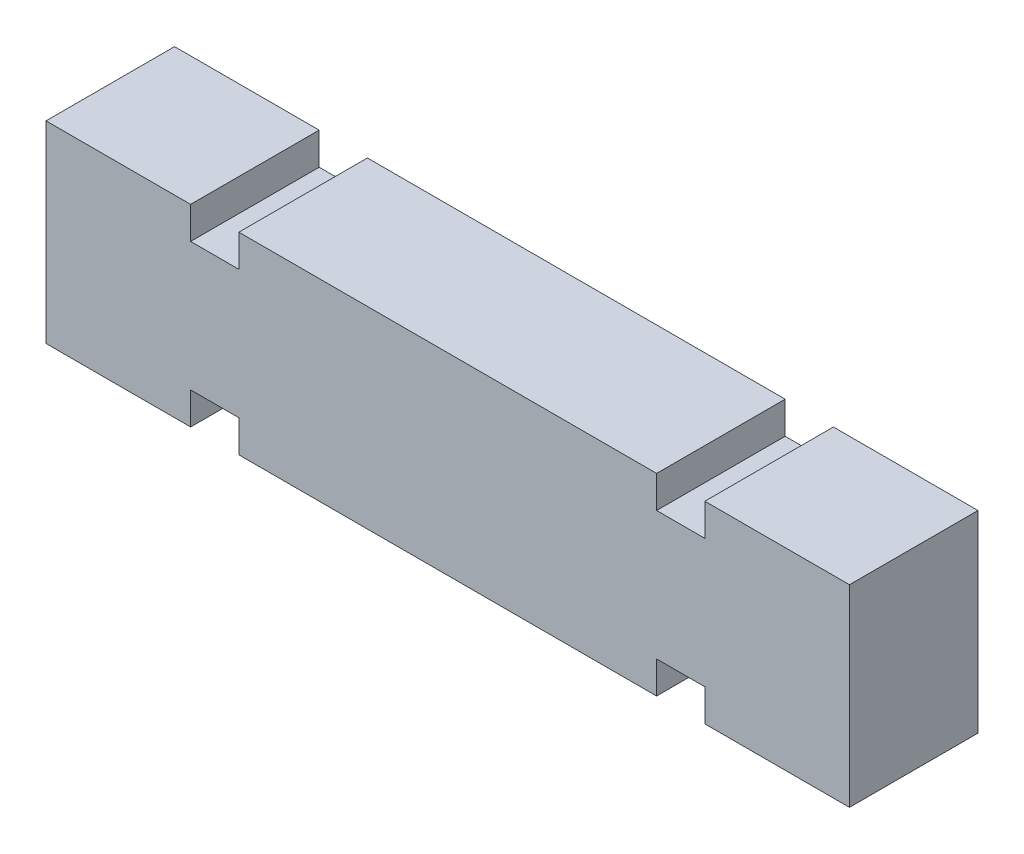
ISO-10303-21;
HEADER;
FILE_DESCRIPTION(('STEP AP214'),'2;1');
FILE_NAME('part.step','',(''),(''),'','','');
FILE_SCHEMA(('AUTOMOTIVE_DESIGN { 1 0 10303 214 1 1 1 1 }'));
ENDSEC;
DATA;
#1=APPLICATION_CONTEXT('core data for automotive mechanical design processes');
#2=APPLICATION_PROTOCOL_DEFINITION('international standard','automotive_design',2000,#1);
#3=PRODUCT_CONTEXT('',#1,'mechanical');
#4=PRODUCT('Part','Part','',(#3));
#5=PRODUCT_RELATED_PRODUCT_CATEGORY('part','',(#4));
#6=PRODUCT_DEFINITION_FORMATION('','',#4);
#7=PRODUCT_DEFINITION_CONTEXT('part definition',#1,'design');
#8=PRODUCT_DEFINITION('design','',#6,#7);
#9=PRODUCT_DEFINITION_SHAPE('','',#8);
#10=(LENGTH_UNIT() NAMED_UNIT(*) SI_UNIT(.MILLI.,.METRE.));
#11=(NAMED_UNIT(*) PLANE_ANGLE_UNIT() SI_UNIT($,.RADIAN.));
#12=(NAMED_UNIT(*) SI_UNIT($,.STERADIAN.) SOLID_ANGLE_UNIT());
#13=UNCERTAINTY_MEASURE_WITH_UNIT(LENGTH_MEASURE(1.E-05),#10,'distance_accuracy_value','');
#14=(GEOMETRIC_REPRESENTATION_CONTEXT(3) GLOBAL_UNCERTAINTY_ASSIGNED_CONTEXT((#13)) GLOBAL_UNIT_ASSIGNED_CONTEXT((#10,
#11,#12)) REPRESENTATION_CONTEXT('',''));
#15=CARTESIAN_POINT('',(0.,0.,0.));
#16=DIRECTION('',(0.,0.,1.));
#17=DIRECTION('',(1.,0.,0.));
#18=AXIS2_PLACEMENT_3D('',#15,#16,#17);
#19=CARTESIAN_POINT('',(25.,0.,-1.99999999999995));
#20=DIRECTION('',(0.,1.,0.));
#21=DIRECTION('',(0.,0.,1.));
#22=AXIS2_PLACEMENT_3D('',#19,#20,#21);
#23=PLANE('',#22);
#24=DIRECTION('',(-1.,0.,0.));
#25=VECTOR('',#24,1.);
#26=CARTESIAN_POINT('',(25.,0.,-1.99999999999995));
#27=LINE('',#26,#25);
#28=CARTESIAN_POINT('',(19.,0.,-1.99999999999995));
#29=VERTEX_POINT('',#28);
#30=CARTESIAN_POINT('',(6.00000000000001,0.,-1.99999999999995));
#31=VERTEX_POINT('',#30);
#32=EDGE_CURVE('E187',#29,#31,#27,.T.);
#33=ORIENTED_EDGE('',*,*,#32,.F.);
#34=DIRECTION('',(0.,0.,1.));
#35=VECTOR('',#34,1.);
#36=CARTESIAN_POINT('',(19.,0.,-10.0000000000001));
#37=LINE('',#36,#35);
#38=CARTESIAN_POINT('',(19.,0.,2.00000000000006));
#39=VERTEX_POINT('',#38);
#40=EDGE_CURVE('E174',#29,#39,#37,.T.);
#41=ORIENTED_EDGE('',*,*,#40,.T.);
#42=DIRECTION('',(-1.,0.,0.));
#43=VECTOR('',#42,1.);
#44=CARTESIAN_POINT('',(25.,0.,2.00000000000006));
#45=LINE('',#44,#43);
#46=CARTESIAN_POINT('',(6.00000000000001,0.,2.00000000000006));
#47=VERTEX_POINT('',#46);
#48=EDGE_CURVE('E209',#39,#47,#45,.T.);
#49=ORIENTED_EDGE('',*,*,#48,.T.);
#50=DIRECTION('',(0.,0.,-1.));
#51=VECTOR('',#50,1.);
#52=CARTESIAN_POINT('',(6.00000000000001,0.,-1.99999999999995));
#53=LINE('',#52,#51);
#54=EDGE_CURVE('E194',#47,#31,#53,.T.);
#55=ORIENTED_EDGE('',*,*,#54,.T.);
#56=EDGE_LOOP('',(#33,#41,#49,#55));
#57=FACE_BOUND('',#56,.T.);
#58=ADVANCED_FACE('F38',(#57),#23,.F.);
#59=CARTESIAN_POINT('',(25.,6.0000000000001,1.99999999999989));
#60=DIRECTION('',(0.,-1.,0.));
#61=DIRECTION('',(0.,0.,-1.));
#62=AXIS2_PLACEMENT_3D('',#59,#60,#61);
#63=PLANE('',#62);
#64=DIRECTION('',(-1.,0.,0.));
#65=VECTOR('',#64,1.);
#66=CARTESIAN_POINT('',(25.,6.0000000000001,1.99999999999989));
#67=LINE('',#66,#65);
#68=CARTESIAN_POINT('',(19.,6.0000000000001,1.99999999999989));
#69=VERTEX_POINT('',#68);
#70=CARTESIAN_POINT('',(6.00000000000001,6.0000000000001,1.99999999999989));
#71=VERTEX_POINT('',#70);
#72=EDGE_CURVE('E214',#69,#71,#67,.T.);
#73=ORIENTED_EDGE('',*,*,#72,.F.);
#74=DIRECTION('',(0.,0.,1.));
#75=VECTOR('',#74,1.);
#76=CARTESIAN_POINT('',(19.,6.00000000000016,-10.));
#77=LINE('',#76,#75);
#78=CARTESIAN_POINT('',(19.,6.00000000000005,-1.99999999999984));
#79=VERTEX_POINT('',#78);
#80=EDGE_CURVE('E266',#79,#69,#77,.T.);
#81=ORIENTED_EDGE('',*,*,#80,.F.);
#82=DIRECTION('',(-1.,0.,0.));
#83=VECTOR('',#82,1.);
#84=CARTESIAN_POINT('',(25.,6.00000000000005,-1.99999999999984));
#85=LINE('',#84,#83);
#86=CARTESIAN_POINT('',(6.00000000000001,6.00000000000005,-1.99999999999984));
#87=VERTEX_POINT('',#86);
#88=EDGE_CURVE('E219',#79,#87,#85,.T.);
#89=ORIENTED_EDGE('',*,*,#88,.T.);
#90=DIRECTION('',(0.,0.,1.));
#91=VECTOR('',#90,1.);
#92=CARTESIAN_POINT('',(6.00000000000001,6.00000000000016,-10.));
#93=LINE('',#92,#91);
#94=EDGE_CURVE('E284',#87,#71,#93,.T.);
#95=ORIENTED_EDGE('',*,*,#94,.T.);
#96=EDGE_LOOP('',(#73,#81,#89,#95));
#97=FACE_BOUND('',#96,.T.);
#98=ADVANCED_FACE('F365',(#97),#63,.F.);
#99=CARTESIAN_POINT('',(4.5,6.0000000000001,1.99999999999989));
#100=VERTEX_POINT('',#99);
#101=CARTESIAN_POINT('',(0.,6.0000000000001,1.99999999999989));
#102=VERTEX_POINT('',#101);
#103=EDGE_CURVE('E208',#100,#102,#67,.T.);
#104=ORIENTED_EDGE('',*,*,#103,.F.);
#105=DIRECTION('',(0.,0.,1.));
#106=VECTOR('',#105,1.);
#107=CARTESIAN_POINT('',(4.5,6.00000000000016,-10.));
#108=LINE('',#107,#106);
#109=CARTESIAN_POINT('',(4.5,6.00000000000005,-1.99999999999984));
#110=VERTEX_POINT('',#109);
#111=EDGE_CURVE('E281',#110,#100,#108,.T.);
#112=ORIENTED_EDGE('',*,*,#111,.F.);
#113=CARTESIAN_POINT('',(0.,6.00000000000005,-1.99999999999984));
#114=VERTEX_POINT('',#113);
#115=EDGE_CURVE('E213',#110,#114,#85,.T.);
#116=ORIENTED_EDGE('',*,*,#115,.T.);
#117=DIRECTION('',(0.,0.,1.));
#118=VECTOR('',#117,1.);
#119=CARTESIAN_POINT('',(0.,6.0000000000001,1.99999999999989));
#120=LINE('',#119,#118);
#121=EDGE_CURVE('E330',#114,#102,#120,.T.);
#122=ORIENTED_EDGE('',*,*,#121,.T.);
#123=EDGE_LOOP('',(#104,#112,#116,#122));
#124=FACE_BOUND('',#123,.T.);
#125=ADVANCED_FACE('F371',(#124),#63,.F.);
#126=CARTESIAN_POINT('',(25.,0.,2.00000000000006));
#127=VERTEX_POINT('',#126);
#128=CARTESIAN_POINT('',(20.5,0.,2.00000000000006));
#129=VERTEX_POINT('',#128);
#130=EDGE_CURVE('E205',#127,#129,#45,.T.);
#131=ORIENTED_EDGE('',*,*,#130,.T.);
#132=DIRECTION('',(0.,0.,1.));
#133=VECTOR('',#132,1.);
#134=CARTESIAN_POINT('',(20.5,0.,-10.0000000000001));
#135=LINE('',#134,#133);
#136=CARTESIAN_POINT('',(20.5,0.,-1.99999999999995));
#137=VERTEX_POINT('',#136);
#138=EDGE_CURVE('E53',#137,#129,#135,.T.);
#139=ORIENTED_EDGE('',*,*,#138,.F.);
#140=CARTESIAN_POINT('',(25.,0.,-1.99999999999995));
#141=VERTEX_POINT('',#140);
#142=EDGE_CURVE('E195',#141,#137,#27,.T.);
#143=ORIENTED_EDGE('',*,*,#142,.F.);
#144=DIRECTION('',(0.,0.,-1.));
#145=VECTOR('',#144,1.);
#146=CARTESIAN_POINT('',(25.,0.,-1.99999999999995));
#147=LINE('',#146,#145);
#148=EDGE_CURVE('E200',#127,#141,#147,.T.);
#149=ORIENTED_EDGE('',*,*,#148,.F.);
#150=EDGE_LOOP('',(#131,#139,#143,#149));
#151=FACE_BOUND('',#150,.T.);
#152=ADVANCED_FACE('F367',(#151),#23,.F.);
#153=CARTESIAN_POINT('',(25.,6.00000000000005,-1.99999999999984));
#154=DIRECTION('',(0.,0.,1.));
#155=DIRECTION('',(1.,0.,0.));
#156=AXIS2_PLACEMENT_3D('',#153,#154,#155);
#157=PLANE('',#156);
#158=DIRECTION('',(-1.,0.,0.));
#159=VECTOR('',#158,1.);
#160=CARTESIAN_POINT('',(25.,1.00000000000006,-2.00000000000006));
#161=LINE('',#160,#159);
#162=CARTESIAN_POINT('',(20.5,1.00000000000006,-2.00000000000006));
#163=VERTEX_POINT('',#162);
#164=CARTESIAN_POINT('',(19.,1.00000000000006,-2.00000000000006));
#165=VERTEX_POINT('',#164);
#166=EDGE_CURVE('E190',#163,#165,#161,.T.);
#167=ORIENTED_EDGE('',*,*,#166,.T.);
#168=DIRECTION('',(0.,-1.,0.));
#169=VECTOR('',#168,1.);
#170=CARTESIAN_POINT('',(19.,6.00000000000005,-1.99999999999984));
#171=LINE('',#170,#169);
#172=EDGE_CURVE('E178',#165,#29,#171,.T.);
#173=ORIENTED_EDGE('',*,*,#172,.T.);
#174=ORIENTED_EDGE('',*,*,#32,.T.);
#175=DIRECTION('',(0.,1.,0.));
#176=VECTOR('',#175,1.);
#177=CARTESIAN_POINT('',(5.99999999999999,6.00000000000005,-1.99999999999984));
#178=LINE('',#177,#176);
#179=CARTESIAN_POINT('',(6.00000000000001,1.00000000000006,-2.00000000000006));
#180=VERTEX_POINT('',#179);
#181=EDGE_CURVE('E314',#31,#180,#178,.T.);
#182=ORIENTED_EDGE('',*,*,#181,.T.);
#183=DIRECTION('',(-1.,0.,0.));
#184=VECTOR('',#183,1.);
#185=CARTESIAN_POINT('',(25.,1.00000000000006,-2.00000000000006));
#186=LINE('',#185,#184);
#187=CARTESIAN_POINT('',(4.5,1.00000000000006,-2.00000000000006));
#188=VERTEX_POINT('',#187);
#189=EDGE_CURVE('E316',#180,#188,#186,.T.);
#190=ORIENTED_EDGE('',*,*,#189,.T.);
#191=DIRECTION('',(0.,-1.,0.));
#192=VECTOR('',#191,1.);
#193=CARTESIAN_POINT('',(4.5,6.00000000000005,-1.99999999999984));
#194=LINE('',#193,#192);
#195=CARTESIAN_POINT('',(4.5,0.,-1.99999999999995));
#196=VERTEX_POINT('',#195);
#197=EDGE_CURVE('E308',#188,#196,#194,.T.);
#198=ORIENTED_EDGE('',*,*,#197,.T.);
#199=CARTESIAN_POINT('',(0.,0.,-1.99999999999995));
#200=VERTEX_POINT('',#199);
#201=EDGE_CURVE('E196',#196,#200,#27,.T.);
#202=ORIENTED_EDGE('',*,*,#201,.T.);
#203=DIRECTION('',(0.,1.,0.));
#204=VECTOR('',#203,1.);
#205=CARTESIAN_POINT('',(0.,6.00000000000005,-1.99999999999984));
#206=LINE('',#205,#204);
#207=EDGE_CURVE('E319',#200,#114,#206,.T.);
#208=ORIENTED_EDGE('',*,*,#207,.T.);
#209=ORIENTED_EDGE('',*,*,#115,.F.);
#210=DIRECTION('',(0.,-1.,0.));
#211=VECTOR('',#210,1.);
#212=CARTESIAN_POINT('',(4.5,6.00000000000005,-1.99999999999984));
#213=LINE('',#212,#211);
#214=CARTESIAN_POINT('',(4.5,5.00000000000014,-1.99999999999984));
#215=VERTEX_POINT('',#214);
#216=EDGE_CURVE('E296',#110,#215,#213,.T.);
#217=ORIENTED_EDGE('',*,*,#216,.T.);
#218=DIRECTION('',(1.,0.,0.));
#219=VECTOR('',#218,1.);
#220=CARTESIAN_POINT('',(25.,5.00000000000014,-1.99999999999984));
#221=LINE('',#220,#219);
#222=CARTESIAN_POINT('',(6.00000000000001,5.00000000000014,-1.99999999999984));
#223=VERTEX_POINT('',#222);
#224=EDGE_CURVE('E283',#215,#223,#221,.T.);
#225=ORIENTED_EDGE('',*,*,#224,.T.);
#226=DIRECTION('',(0.,1.,0.));
#227=VECTOR('',#226,1.);
#228=CARTESIAN_POINT('',(6.00000000000001,6.00000000000006,-1.99999999999989));
#229=LINE('',#228,#227);
#230=EDGE_CURVE('E293',#223,#87,#229,.T.);
#231=ORIENTED_EDGE('',*,*,#230,.T.);
#232=ORIENTED_EDGE('',*,*,#88,.F.);
#233=DIRECTION('',(0.,-1.,0.));
#234=VECTOR('',#233,1.);
#235=CARTESIAN_POINT('',(19.,6.00000000000005,-1.99999999999984));
#236=LINE('',#235,#234);
#237=CARTESIAN_POINT('',(19.,5.00000000000014,-1.99999999999984));
#238=VERTEX_POINT('',#237);
#239=EDGE_CURVE('E274',#79,#238,#236,.T.);
#240=ORIENTED_EDGE('',*,*,#239,.T.);
#241=DIRECTION('',(1.,0.,0.));
#242=VECTOR('',#241,1.);
#243=CARTESIAN_POINT('',(25.,5.00000000000014,-1.99999999999984));
#244=LINE('',#243,#242);
#245=CARTESIAN_POINT('',(20.5,5.00000000000014,-1.99999999999984));
#246=VERTEX_POINT('',#245);
#247=EDGE_CURVE('E277',#238,#246,#244,.T.);
#248=ORIENTED_EDGE('',*,*,#247,.T.);
#249=DIRECTION('',(0.,1.,0.));
#250=VECTOR('',#249,1.);
#251=CARTESIAN_POINT('',(20.5,6.00000000000005,-1.99999999999984));
#252=LINE('',#251,#250);
#253=CARTESIAN_POINT('',(20.5,6.00000000000005,-1.99999999999984));
#254=VERTEX_POINT('',#253);
#255=EDGE_CURVE('E265',#246,#254,#252,.T.);
#256=ORIENTED_EDGE('',*,*,#255,.T.);
#257=CARTESIAN_POINT('',(25.,6.00000000000005,-1.99999999999984));
#258=VERTEX_POINT('',#257);
#259=EDGE_CURVE('E215',#258,#254,#85,.T.);
#260=ORIENTED_EDGE('',*,*,#259,.F.);
#261=DIRECTION('',(0.,1.,0.));
#262=VECTOR('',#261,1.);
#263=CARTESIAN_POINT('',(25.,6.00000000000005,-1.99999999999984));
#264=LINE('',#263,#262);
#265=EDGE_CURVE('E320',#141,#258,#264,.T.);
#266=ORIENTED_EDGE('',*,*,#265,.F.);
#267=ORIENTED_EDGE('',*,*,#142,.T.);
#268=DIRECTION('',(0.,1.,0.));
#269=VECTOR('',#268,1.);
#270=CARTESIAN_POINT('',(20.5,6.00000000000005,-1.99999999999984));
#271=LINE('',#270,#269);
#272=EDGE_CURVE('E255',#137,#163,#271,.T.);
#273=ORIENTED_EDGE('',*,*,#272,.T.);
#274=EDGE_LOOP('',(#167,#173,#174,#182,#190,#198,#202,#208,#209,#217,#225,#231,#232,#240,#248,
#256,#260,#266,#267,#273));
#275=FACE_BOUND('',#274,.T.);
#276=ADVANCED_FACE('F40',(#275),#157,.F.);
#277=ORIENTED_EDGE('',*,*,#259,.T.);
#278=DIRECTION('',(0.,0.,1.));
#279=VECTOR('',#278,1.);
#280=CARTESIAN_POINT('',(20.5,6.00000000000016,-10.));
#281=LINE('',#280,#279);
#282=CARTESIAN_POINT('',(20.5,6.0000000000001,1.99999999999989));
#283=VERTEX_POINT('',#282);
#284=EDGE_CURVE('E268',#254,#283,#281,.T.);
#285=ORIENTED_EDGE('',*,*,#284,.T.);
#286=CARTESIAN_POINT('',(25.,6.0000000000001,1.99999999999989));
#287=VERTEX_POINT('',#286);
#288=EDGE_CURVE('E210',#287,#283,#67,.T.);
#289=ORIENTED_EDGE('',*,*,#288,.F.);
#290=DIRECTION('',(0.,0.,1.));
#291=VECTOR('',#290,1.);
#292=CARTESIAN_POINT('',(25.,6.0000000000001,1.99999999999989));
#293=LINE('',#292,#291);
#294=EDGE_CURVE('E323',#258,#287,#293,.T.);
#295=ORIENTED_EDGE('',*,*,#294,.F.);
#296=EDGE_LOOP('',(#277,#285,#289,#295));
#297=FACE_BOUND('',#296,.T.);
#298=ADVANCED_FACE('F373',(#297),#63,.F.);
#299=CARTESIAN_POINT('',(25.,6.0000000000001,1.99999999999989));
#300=DIRECTION('',(0.,0.,-1.));
#301=DIRECTION('',(-1.,0.,0.));
#302=AXIS2_PLACEMENT_3D('',#299,#300,#301);
#303=PLANE('',#302);
#304=ORIENTED_EDGE('',*,*,#48,.F.);
#305=DIRECTION('',(0.,1.,0.));
#306=VECTOR('',#305,1.);
#307=CARTESIAN_POINT('',(19.,6.0000000000001,1.99999999999989));
#308=LINE('',#307,#306);
#309=CARTESIAN_POINT('',(19.,1.00000000000011,2.00000000000006));
#310=VERTEX_POINT('',#309);
#311=EDGE_CURVE('E11',#39,#310,#308,.T.);
#312=ORIENTED_EDGE('',*,*,#311,.T.);
#313=DIRECTION('',(1.,0.,0.));
#314=VECTOR('',#313,1.);
#315=CARTESIAN_POINT('',(25.,1.00000000000011,2.00000000000006));
#316=LINE('',#315,#314);
#317=CARTESIAN_POINT('',(20.5,1.00000000000011,2.00000000000006));
#318=VERTEX_POINT('',#317);
#319=EDGE_CURVE('E46',#310,#318,#316,.T.);
#320=ORIENTED_EDGE('',*,*,#319,.T.);
#321=DIRECTION('',(0.,-1.,0.));
#322=VECTOR('',#321,1.);
#323=CARTESIAN_POINT('',(20.5,6.0000000000001,1.99999999999989));
#324=LINE('',#323,#322);
#325=EDGE_CURVE('E244',#318,#129,#324,.T.);
#326=ORIENTED_EDGE('',*,*,#325,.T.);
#327=ORIENTED_EDGE('',*,*,#130,.F.);
#328=DIRECTION('',(0.,-1.,0.));
#329=VECTOR('',#328,1.);
#330=CARTESIAN_POINT('',(25.,6.0000000000001,1.99999999999989));
#331=LINE('',#330,#329);
#332=EDGE_CURVE('E325',#287,#127,#331,.T.);
#333=ORIENTED_EDGE('',*,*,#332,.F.);
#334=ORIENTED_EDGE('',*,*,#288,.T.);
#335=DIRECTION('',(0.,-1.,0.));
#336=VECTOR('',#335,1.);
#337=CARTESIAN_POINT('',(20.5,6.0000000000001,1.99999999999989));
#338=LINE('',#337,#336);
#339=CARTESIAN_POINT('',(20.5,5.00000000000007,2.00000000000006));
#340=VERTEX_POINT('',#339);
#341=EDGE_CURVE('E235',#283,#340,#338,.T.);
#342=ORIENTED_EDGE('',*,*,#341,.T.);
#343=DIRECTION('',(-1.,0.,0.));
#344=VECTOR('',#343,1.);
#345=CARTESIAN_POINT('',(25.,5.00000000000007,2.00000000000006));
#346=LINE('',#345,#344);
#347=CARTESIAN_POINT('',(19.,5.00000000000007,2.00000000000006));
#348=VERTEX_POINT('',#347);
#349=EDGE_CURVE('E238',#340,#348,#346,.T.);
#350=ORIENTED_EDGE('',*,*,#349,.T.);
#351=DIRECTION('',(0.,1.,0.));
#352=VECTOR('',#351,1.);
#353=CARTESIAN_POINT('',(19.,6.0000000000001,1.99999999999989));
#354=LINE('',#353,#352);
#355=EDGE_CURVE('E241',#348,#69,#354,.T.);
#356=ORIENTED_EDGE('',*,*,#355,.T.);
#357=ORIENTED_EDGE('',*,*,#72,.T.);
#358=DIRECTION('',(0.,-1.,0.));
#359=VECTOR('',#358,1.);
#360=CARTESIAN_POINT('',(6.00000000000001,6.00000000000034,2.00000000000006));
#361=LINE('',#360,#359);
#362=CARTESIAN_POINT('',(6.00000000000001,5.00000000000007,2.00000000000006));
#363=VERTEX_POINT('',#362);
#364=EDGE_CURVE('E229',#71,#363,#361,.T.);
#365=ORIENTED_EDGE('',*,*,#364,.T.);
#366=DIRECTION('',(-1.,0.,0.));
#367=VECTOR('',#366,1.);
#368=CARTESIAN_POINT('',(25.,5.00000000000007,2.00000000000006));
#369=LINE('',#368,#367);
#370=CARTESIAN_POINT('',(4.5,5.00000000000007,2.00000000000006));
#371=VERTEX_POINT('',#370);
#372=EDGE_CURVE('E226',#363,#371,#369,.T.);
#373=ORIENTED_EDGE('',*,*,#372,.T.);
#374=DIRECTION('',(0.,1.,0.));
#375=VECTOR('',#374,1.);
#376=CARTESIAN_POINT('',(4.5,6.0000000000001,1.99999999999989));
#377=LINE('',#376,#375);
#378=EDGE_CURVE('E232',#371,#100,#377,.T.);
#379=ORIENTED_EDGE('',*,*,#378,.T.);
#380=ORIENTED_EDGE('',*,*,#103,.T.);
#381=DIRECTION('',(0.,-1.,0.));
#382=VECTOR('',#381,1.);
#383=CARTESIAN_POINT('',(0.,6.0000000000001,1.99999999999989));
#384=LINE('',#383,#382);
#385=CARTESIAN_POINT('',(0.,0.,2.00000000000006));
#386=VERTEX_POINT('',#385);
#387=EDGE_CURVE('E332',#102,#386,#384,.T.);
#388=ORIENTED_EDGE('',*,*,#387,.T.);
#389=CARTESIAN_POINT('',(4.5,0.,2.00000000000006));
#390=VERTEX_POINT('',#389);
#391=EDGE_CURVE('E199',#390,#386,#45,.T.);
#392=ORIENTED_EDGE('',*,*,#391,.F.);
#393=DIRECTION('',(0.,1.,0.));
#394=VECTOR('',#393,1.);
#395=CARTESIAN_POINT('',(4.5,6.0000000000001,1.99999999999989));
#396=LINE('',#395,#394);
#397=CARTESIAN_POINT('',(4.5,1.00000000000011,2.00000000000006));
#398=VERTEX_POINT('',#397);
#399=EDGE_CURVE('E303',#390,#398,#396,.T.);
#400=ORIENTED_EDGE('',*,*,#399,.T.);
#401=DIRECTION('',(1.,0.,0.));
#402=VECTOR('',#401,1.);
#403=CARTESIAN_POINT('',(25.,1.00000000000011,2.00000000000006));
#404=LINE('',#403,#402);
#405=CARTESIAN_POINT('',(6.00000000000001,1.00000000000011,2.00000000000006));
#406=VERTEX_POINT('',#405);
#407=EDGE_CURVE('E223',#398,#406,#404,.T.);
#408=ORIENTED_EDGE('',*,*,#407,.T.);
#409=DIRECTION('',(0.,-1.,0.));
#410=VECTOR('',#409,1.);
#411=CARTESIAN_POINT('',(5.99999999999999,6.0000000000001,1.99999999999989));
#412=LINE('',#411,#410);
#413=EDGE_CURVE('E311',#406,#47,#412,.T.);
#414=ORIENTED_EDGE('',*,*,#413,.T.);
#415=EDGE_LOOP('',(#304,#312,#320,#326,#327,#333,#334,#342,#350,#356,#357,#365,#373,#379,#380,
#388,#392,#400,#408,#414));
#416=FACE_BOUND('',#415,.T.);
#417=ADVANCED_FACE('F247',(#416),#303,.F.);
#418=ORIENTED_EDGE('',*,*,#201,.F.);
#419=DIRECTION('',(0.,0.,1.));
#420=VECTOR('',#419,1.);
#421=CARTESIAN_POINT('',(4.5,0.,-1.99999999999995));
#422=LINE('',#421,#420);
#423=EDGE_CURVE('E218',#196,#390,#422,.T.);
#424=ORIENTED_EDGE('',*,*,#423,.T.);
#425=ORIENTED_EDGE('',*,*,#391,.T.);
#426=DIRECTION('',(0.,0.,-1.));
#427=VECTOR('',#426,1.);
#428=CARTESIAN_POINT('',(0.,0.,-1.99999999999995));
#429=LINE('',#428,#427);
#430=EDGE_CURVE('E203',#386,#200,#429,.T.);
#431=ORIENTED_EDGE('',*,*,#430,.T.);
#432=EDGE_LOOP('',(#418,#424,#425,#431));
#433=FACE_BOUND('',#432,.T.);
#434=ADVANCED_FACE('F341',(#433),#23,.F.);
#435=CARTESIAN_POINT('',(25.,0.,0.));
#436=DIRECTION('',(-1.,0.,0.));
#437=DIRECTION('',(0.,0.,1.));
#438=AXIS2_PLACEMENT_3D('',#435,#436,#437);
#439=PLANE('',#438);
#440=ORIENTED_EDGE('',*,*,#265,.T.);
#441=ORIENTED_EDGE('',*,*,#294,.T.);
#442=ORIENTED_EDGE('',*,*,#332,.T.);
#443=ORIENTED_EDGE('',*,*,#148,.T.);
#444=EDGE_LOOP('',(#440,#441,#442,#443));
#445=FACE_BOUND('',#444,.T.);
#446=ADVANCED_FACE('F379',(#445),#439,.F.);
#447=CARTESIAN_POINT('',(0.,0.,0.));
#448=DIRECTION('',(-1.,0.,0.));
#449=DIRECTION('',(0.,0.,1.));
#450=AXIS2_PLACEMENT_3D('',#447,#448,#449);
#451=PLANE('',#450);
#452=ORIENTED_EDGE('',*,*,#207,.F.);
#453=ORIENTED_EDGE('',*,*,#430,.F.);
#454=ORIENTED_EDGE('',*,*,#387,.F.);
#455=ORIENTED_EDGE('',*,*,#121,.F.);
#456=EDGE_LOOP('',(#452,#453,#454,#455));
#457=FACE_BOUND('',#456,.T.);
#458=ADVANCED_FACE('F344',(#457),#451,.T.);
#459=CARTESIAN_POINT('',(6.00000000000001,1.00000000000021,-10.0000000000001));
#460=DIRECTION('',(0.,1.,0.));
#461=DIRECTION('',(0.,0.,1.));
#462=AXIS2_PLACEMENT_3D('',#459,#460,#461);
#463=PLANE('',#462);
#464=DIRECTION('',(0.,0.,1.));
#465=VECTOR('',#464,1.);
#466=CARTESIAN_POINT('',(6.00000000000001,1.00000000000021,-10.0000000000001));
#467=LINE('',#466,#465);
#468=EDGE_CURVE('E299',#180,#406,#467,.T.);
#469=ORIENTED_EDGE('',*,*,#468,.T.);
#470=ORIENTED_EDGE('',*,*,#407,.F.);
#471=DIRECTION('',(0.,0.,1.));
#472=VECTOR('',#471,1.);
#473=CARTESIAN_POINT('',(4.5,1.00000000000021,-10.0000000000001));
#474=LINE('',#473,#472);
#475=EDGE_CURVE('E300',#188,#398,#474,.T.);
#476=ORIENTED_EDGE('',*,*,#475,.F.);
#477=ORIENTED_EDGE('',*,*,#189,.F.);
#478=EDGE_LOOP('',(#469,#470,#476,#477));
#479=FACE_BOUND('',#478,.T.);
#480=ADVANCED_FACE('F350',(#479),#463,.F.);
#481=CARTESIAN_POINT('',(6.00000000000001,0.,-10.0000000000001));
#482=DIRECTION('',(1.,0.,0.));
#483=DIRECTION('',(0.,1.,0.));
#484=AXIS2_PLACEMENT_3D('',#481,#482,#483);
#485=PLANE('',#484);
#486=ORIENTED_EDGE('',*,*,#54,.F.);
#487=ORIENTED_EDGE('',*,*,#413,.F.);
#488=ORIENTED_EDGE('',*,*,#468,.F.);
#489=ORIENTED_EDGE('',*,*,#181,.F.);
#490=EDGE_LOOP('',(#486,#487,#488,#489));
#491=FACE_BOUND('',#490,.T.);
#492=ADVANCED_FACE('F353',(#491),#485,.F.);
#493=CARTESIAN_POINT('',(4.5,1.00000000000021,-10.0000000000001));
#494=DIRECTION('',(-1.,0.,0.));
#495=DIRECTION('',(0.,0.,1.));
#496=AXIS2_PLACEMENT_3D('',#493,#494,#495);
#497=PLANE('',#496);
#498=ORIENTED_EDGE('',*,*,#475,.T.);
#499=ORIENTED_EDGE('',*,*,#399,.F.);
#500=ORIENTED_EDGE('',*,*,#423,.F.);
#501=ORIENTED_EDGE('',*,*,#197,.F.);
#502=EDGE_LOOP('',(#498,#499,#500,#501));
#503=FACE_BOUND('',#502,.T.);
#504=ADVANCED_FACE('F348',(#503),#497,.F.);
#505=CARTESIAN_POINT('',(4.5,5.00000000000009,-10.));
#506=DIRECTION('',(-1.,0.,0.));
#507=DIRECTION('',(0.,0.,1.));
#508=AXIS2_PLACEMENT_3D('',#505,#506,#507);
#509=PLANE('',#508);
#510=ORIENTED_EDGE('',*,*,#111,.T.);
#511=ORIENTED_EDGE('',*,*,#378,.F.);
#512=DIRECTION('',(0.,0.,1.));
#513=VECTOR('',#512,1.);
#514=CARTESIAN_POINT('',(4.5,5.00000000000009,-10.));
#515=LINE('',#514,#513);
#516=EDGE_CURVE('E280',#215,#371,#515,.T.);
#517=ORIENTED_EDGE('',*,*,#516,.F.);
#518=ORIENTED_EDGE('',*,*,#216,.F.);
#519=EDGE_LOOP('',(#510,#511,#517,#518));
#520=FACE_BOUND('',#519,.T.);
#521=ADVANCED_FACE('F360',(#520),#509,.F.);
#522=CARTESIAN_POINT('',(6.00000000000001,6.00000000000016,-10.));
#523=DIRECTION('',(1.,0.,0.));
#524=DIRECTION('',(0.,1.,0.));
#525=AXIS2_PLACEMENT_3D('',#522,#523,#524);
#526=PLANE('',#525);
#527=DIRECTION('',(0.,0.,1.));
#528=VECTOR('',#527,1.);
#529=CARTESIAN_POINT('',(6.00000000000001,5.00000000000009,-10.));
#530=LINE('',#529,#528);
#531=EDGE_CURVE('E287',#223,#363,#530,.T.);
#532=ORIENTED_EDGE('',*,*,#531,.T.);
#533=ORIENTED_EDGE('',*,*,#364,.F.);
#534=ORIENTED_EDGE('',*,*,#94,.F.);
#535=ORIENTED_EDGE('',*,*,#230,.F.);
#536=EDGE_LOOP('',(#532,#533,#534,#535));
#537=FACE_BOUND('',#536,.T.);
#538=ADVANCED_FACE('F403',(#537),#526,.F.);
#539=CARTESIAN_POINT('',(6.00000000000001,5.00000000000009,-10.));
#540=DIRECTION('',(0.,-1.,0.));
#541=DIRECTION('',(0.,0.,-1.));
#542=AXIS2_PLACEMENT_3D('',#539,#540,#541);
#543=PLANE('',#542);
#544=ORIENTED_EDGE('',*,*,#516,.T.);
#545=ORIENTED_EDGE('',*,*,#372,.F.);
#546=ORIENTED_EDGE('',*,*,#531,.F.);
#547=ORIENTED_EDGE('',*,*,#224,.F.);
#548=EDGE_LOOP('',(#544,#545,#546,#547));
#549=FACE_BOUND('',#548,.T.);
#550=ADVANCED_FACE('F407',(#549),#543,.F.);
#551=CARTESIAN_POINT('',(19.,5.00000000000009,-10.));
#552=DIRECTION('',(0.,-1.,0.));
#553=DIRECTION('',(0.,0.,-1.));
#554=AXIS2_PLACEMENT_3D('',#551,#552,#553);
#555=PLANE('',#554);
#556=DIRECTION('',(0.,0.,1.));
#557=VECTOR('',#556,1.);
#558=CARTESIAN_POINT('',(19.,5.00000000000009,-10.));
#559=LINE('',#558,#557);
#560=EDGE_CURVE('E262',#238,#348,#559,.T.);
#561=ORIENTED_EDGE('',*,*,#560,.T.);
#562=ORIENTED_EDGE('',*,*,#349,.F.);
#563=DIRECTION('',(0.,0.,1.));
#564=VECTOR('',#563,1.);
#565=CARTESIAN_POINT('',(20.5,5.00000000000009,-10.));
#566=LINE('',#565,#564);
#567=EDGE_CURVE('E61',#246,#340,#566,.T.);
#568=ORIENTED_EDGE('',*,*,#567,.F.);
#569=ORIENTED_EDGE('',*,*,#247,.F.);
#570=EDGE_LOOP('',(#561,#562,#568,#569));
#571=FACE_BOUND('',#570,.T.);
#572=ADVANCED_FACE('F419',(#571),#555,.F.);
#573=CARTESIAN_POINT('',(19.,6.00000000000016,-10.));
#574=DIRECTION('',(-1.,0.,0.));
#575=DIRECTION('',(0.,0.,1.));
#576=AXIS2_PLACEMENT_3D('',#573,#574,#575);
#577=PLANE('',#576);
#578=ORIENTED_EDGE('',*,*,#80,.T.);
#579=ORIENTED_EDGE('',*,*,#355,.F.);
#580=ORIENTED_EDGE('',*,*,#560,.F.);
#581=ORIENTED_EDGE('',*,*,#239,.F.);
#582=EDGE_LOOP('',(#578,#579,#580,#581));
#583=FACE_BOUND('',#582,.T.);
#584=ADVANCED_FACE('F423',(#583),#577,.F.);
#585=CARTESIAN_POINT('',(20.5,5.00000000000009,-10.));
#586=DIRECTION('',(1.,0.,0.));
#587=DIRECTION('',(0.,0.,-1.));
#588=AXIS2_PLACEMENT_3D('',#585,#586,#587);
#589=PLANE('',#588);
#590=ORIENTED_EDGE('',*,*,#567,.T.);
#591=ORIENTED_EDGE('',*,*,#341,.F.);
#592=ORIENTED_EDGE('',*,*,#284,.F.);
#593=ORIENTED_EDGE('',*,*,#255,.F.);
#594=EDGE_LOOP('',(#590,#591,#592,#593));
#595=FACE_BOUND('',#594,.T.);
#596=ADVANCED_FACE('F425',(#595),#589,.F.);
#597=CARTESIAN_POINT('',(19.,0.,-10.0000000000001));
#598=DIRECTION('',(-1.,0.,0.));
#599=DIRECTION('',(0.,0.,1.));
#600=AXIS2_PLACEMENT_3D('',#597,#598,#599);
#601=PLANE('',#600);
#602=DIRECTION('',(0.,0.,1.));
#603=VECTOR('',#602,1.);
#604=CARTESIAN_POINT('',(19.,1.00000000000021,-10.0000000000001));
#605=LINE('',#604,#603);
#606=EDGE_CURVE('E252',#165,#310,#605,.T.);
#607=ORIENTED_EDGE('',*,*,#606,.T.);
#608=ORIENTED_EDGE('',*,*,#311,.F.);
#609=ORIENTED_EDGE('',*,*,#40,.F.);
#610=ORIENTED_EDGE('',*,*,#172,.F.);
#611=EDGE_LOOP('',(#607,#608,#609,#610));
#612=FACE_BOUND('',#611,.T.);
#613=ADVANCED_FACE('F177',(#612),#601,.F.);
#614=CARTESIAN_POINT('',(19.,1.00000000000021,-10.0000000000001));
#615=DIRECTION('',(0.,1.,0.));
#616=DIRECTION('',(0.,0.,1.));
#617=AXIS2_PLACEMENT_3D('',#614,#615,#616);
#618=PLANE('',#617);
#619=DIRECTION('',(0.,0.,1.));
#620=VECTOR('',#619,1.);
#621=CARTESIAN_POINT('',(20.5,1.00000000000021,-10.0000000000001));
#622=LINE('',#621,#620);
#623=EDGE_CURVE('E254',#163,#318,#622,.T.);
#624=ORIENTED_EDGE('',*,*,#623,.T.);
#625=ORIENTED_EDGE('',*,*,#319,.F.);
#626=ORIENTED_EDGE('',*,*,#606,.F.);
#627=ORIENTED_EDGE('',*,*,#166,.F.);
#628=EDGE_LOOP('',(#624,#625,#626,#627));
#629=FACE_BOUND('',#628,.T.);
#630=ADVANCED_FACE('F251',(#629),#618,.F.);
#631=CARTESIAN_POINT('',(20.5,1.00000000000021,-10.0000000000001));
#632=DIRECTION('',(1.,0.,0.));
#633=DIRECTION('',(0.,0.,-1.));
#634=AXIS2_PLACEMENT_3D('',#631,#632,#633);
#635=PLANE('',#634);
#636=ORIENTED_EDGE('',*,*,#138,.T.);
#637=ORIENTED_EDGE('',*,*,#325,.F.);
#638=ORIENTED_EDGE('',*,*,#623,.F.);
#639=ORIENTED_EDGE('',*,*,#272,.F.);
#640=EDGE_LOOP('',(#636,#637,#638,#639));
#641=FACE_BOUND('',#640,.T.);
#642=ADVANCED_FACE('F433',(#641),#635,.F.);
#643=CLOSED_SHELL('',(#58,#98,#125,#152,#276,#298,#417,#434,#446,#458,#480,#492,#504,#521,#538,
#550,#572,#584,#596,#613,#630,#642));
#644=MANIFOLD_SOLID_BREP('B2',#643);
#645=ADVANCED_BREP_SHAPE_REPRESENTATION('',(#18,#644),#14);
#646=SHAPE_DEFINITION_REPRESENTATION(#9,#645);
ENDSEC;
END-ISO-10303-21;
